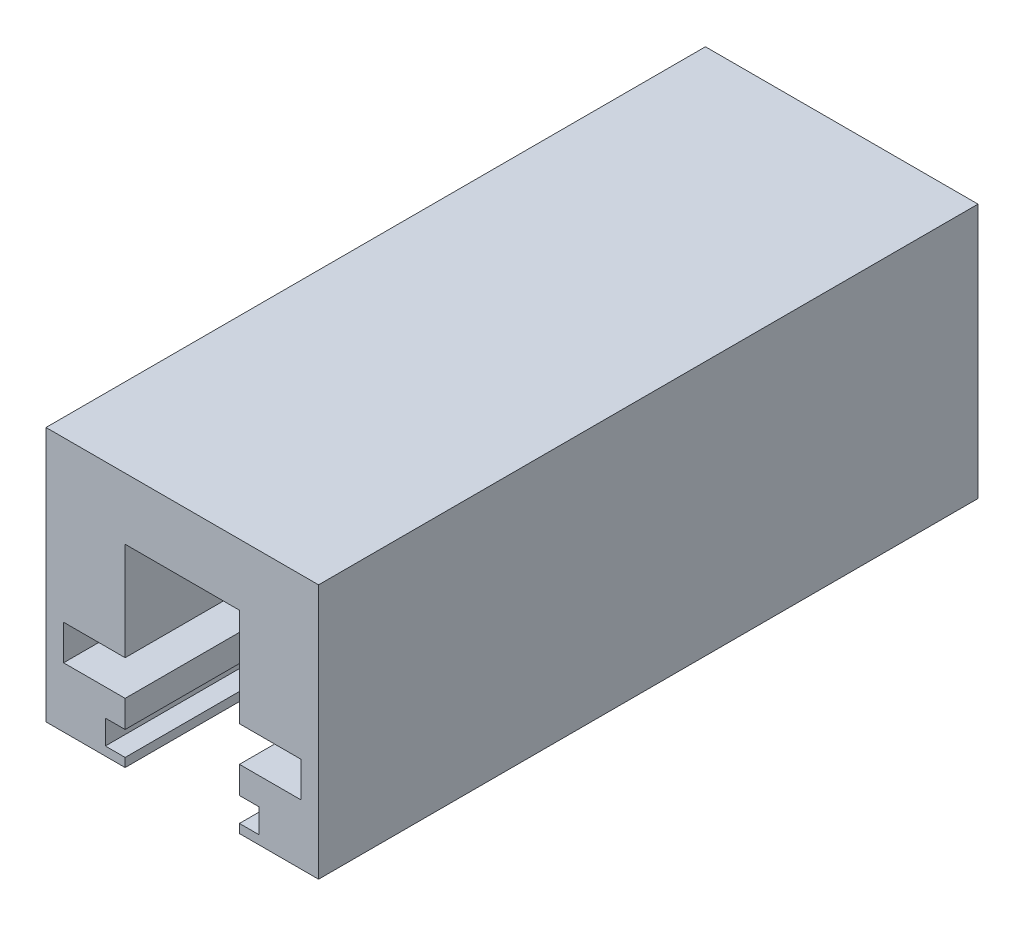
ISO-10303-21;
HEADER;
FILE_DESCRIPTION(('STEP AP214'),'2;1');
FILE_NAME('part.step','',(''),(''),'','','');
FILE_SCHEMA(('AUTOMOTIVE_DESIGN { 1 0 10303 214 1 1 1 1 }'));
ENDSEC;
DATA;
#1=APPLICATION_CONTEXT('core data for automotive mechanical design processes');
#2=APPLICATION_PROTOCOL_DEFINITION('international standard','automotive_design',2000,#1);
#3=PRODUCT_CONTEXT('',#1,'mechanical');
#4=PRODUCT('Part','Part','',(#3));
#5=PRODUCT_RELATED_PRODUCT_CATEGORY('part','',(#4));
#6=PRODUCT_DEFINITION_FORMATION('','',#4);
#7=PRODUCT_DEFINITION_CONTEXT('part definition',#1,'design');
#8=PRODUCT_DEFINITION('design','',#6,#7);
#9=PRODUCT_DEFINITION_SHAPE('','',#8);
#10=(LENGTH_UNIT() NAMED_UNIT(*) SI_UNIT(.MILLI.,.METRE.));
#11=(NAMED_UNIT(*) PLANE_ANGLE_UNIT() SI_UNIT($,.RADIAN.));
#12=(NAMED_UNIT(*) SI_UNIT($,.STERADIAN.) SOLID_ANGLE_UNIT());
#13=UNCERTAINTY_MEASURE_WITH_UNIT(LENGTH_MEASURE(1.E-05),#10,'distance_accuracy_value','');
#14=(GEOMETRIC_REPRESENTATION_CONTEXT(3) GLOBAL_UNCERTAINTY_ASSIGNED_CONTEXT((#13)) GLOBAL_UNIT_ASSIGNED_CONTEXT((#10,
#11,#12)) REPRESENTATION_CONTEXT('',''));
#15=CARTESIAN_POINT('',(0.,0.,0.));
#16=DIRECTION('',(0.,0.,1.));
#17=DIRECTION('',(1.,0.,0.));
#18=AXIS2_PLACEMENT_3D('',#15,#16,#17);
#19=CARTESIAN_POINT('',(0.,10.82,75.));
#20=DIRECTION('',(0.,-1.,0.));
#21=DIRECTION('',(1.,0.,0.));
#22=AXIS2_PLACEMENT_3D('',#19,#20,#21);
#23=PLANE('',#22);
#24=DIRECTION('',(-1.,0.,0.));
#25=VECTOR('',#24,1.);
#26=CARTESIAN_POINT('',(0.,10.82,0.));
#27=LINE('',#26,#25);
#28=CARTESIAN_POINT('',(-2.,10.82,0.));
#29=VERTEX_POINT('',#28);
#30=CARTESIAN_POINT('',(-9.,10.82,0.));
#31=VERTEX_POINT('',#30);
#32=EDGE_CURVE('E228',#29,#31,#27,.T.);
#33=ORIENTED_EDGE('',*,*,#32,.F.);
#34=DIRECTION('',(0.,0.,-1.));
#35=VECTOR('',#34,1.);
#36=CARTESIAN_POINT('',(-2.,10.82,75.));
#37=LINE('',#36,#35);
#38=CARTESIAN_POINT('',(-2.,10.82,75.));
#39=VERTEX_POINT('',#38);
#40=EDGE_CURVE('E11',#39,#29,#37,.T.);
#41=ORIENTED_EDGE('',*,*,#40,.F.);
#42=DIRECTION('',(-1.,0.,0.));
#43=VECTOR('',#42,1.);
#44=CARTESIAN_POINT('',(0.,10.82,75.));
#45=LINE('',#44,#43);
#46=CARTESIAN_POINT('',(-9.,10.82,75.));
#47=VERTEX_POINT('',#46);
#48=EDGE_CURVE('E351',#39,#47,#45,.T.);
#49=ORIENTED_EDGE('',*,*,#48,.T.);
#50=DIRECTION('',(0.,0.,-1.));
#51=VECTOR('',#50,1.);
#52=CARTESIAN_POINT('',(-9.,10.82,75.));
#53=LINE('',#52,#51);
#54=EDGE_CURVE('E51',#47,#31,#53,.T.);
#55=ORIENTED_EDGE('',*,*,#54,.T.);
#56=EDGE_LOOP('',(#33,#41,#49,#55));
#57=FACE_BOUND('',#56,.T.);
#58=ADVANCED_FACE('F35',(#57),#23,.T.);
#59=CARTESIAN_POINT('',(-2.,0.,75.));
#60=DIRECTION('',(-1.,0.,0.));
#61=DIRECTION('',(0.,0.,1.));
#62=AXIS2_PLACEMENT_3D('',#59,#60,#61);
#63=PLANE('',#62);
#64=DIRECTION('',(0.,1.,0.));
#65=VECTOR('',#64,1.);
#66=CARTESIAN_POINT('',(-2.,0.,0.));
#67=LINE('',#66,#65);
#68=CARTESIAN_POINT('',(-2.,6.81999999999999,0.));
#69=VERTEX_POINT('',#68);
#70=EDGE_CURVE('E230',#69,#29,#67,.T.);
#71=ORIENTED_EDGE('',*,*,#70,.F.);
#72=DIRECTION('',(0.,0.,-1.));
#73=VECTOR('',#72,1.);
#74=CARTESIAN_POINT('',(-2.,6.81999999999999,75.));
#75=LINE('',#74,#73);
#76=CARTESIAN_POINT('',(-2.,6.81999999999999,75.));
#77=VERTEX_POINT('',#76);
#78=EDGE_CURVE('E43',#77,#69,#75,.T.);
#79=ORIENTED_EDGE('',*,*,#78,.F.);
#80=DIRECTION('',(0.,1.,0.));
#81=VECTOR('',#80,1.);
#82=CARTESIAN_POINT('',(-2.,0.,75.));
#83=LINE('',#82,#81);
#84=EDGE_CURVE('E348',#77,#39,#83,.T.);
#85=ORIENTED_EDGE('',*,*,#84,.T.);
#86=ORIENTED_EDGE('',*,*,#40,.T.);
#87=EDGE_LOOP('',(#71,#79,#85,#86));
#88=FACE_BOUND('',#87,.T.);
#89=ADVANCED_FACE('F337',(#88),#63,.T.);
#90=CARTESIAN_POINT('',(0.,6.81999999999999,75.));
#91=DIRECTION('',(0.,1.,0.));
#92=DIRECTION('',(0.,0.,1.));
#93=AXIS2_PLACEMENT_3D('',#90,#91,#92);
#94=PLANE('',#93);
#95=DIRECTION('',(1.,0.,0.));
#96=VECTOR('',#95,1.);
#97=CARTESIAN_POINT('',(0.,6.81999999999999,0.));
#98=LINE('',#97,#96);
#99=CARTESIAN_POINT('',(-9.,6.81999999999999,0.));
#100=VERTEX_POINT('',#99);
#101=EDGE_CURVE('E233',#100,#69,#98,.T.);
#102=ORIENTED_EDGE('',*,*,#101,.F.);
#103=DIRECTION('',(0.,0.,-1.));
#104=VECTOR('',#103,1.);
#105=CARTESIAN_POINT('',(-9.,6.81999999999999,75.));
#106=LINE('',#105,#104);
#107=CARTESIAN_POINT('',(-9.,6.81999999999999,75.));
#108=VERTEX_POINT('',#107);
#109=EDGE_CURVE('E326',#108,#100,#106,.T.);
#110=ORIENTED_EDGE('',*,*,#109,.F.);
#111=DIRECTION('',(1.,0.,0.));
#112=VECTOR('',#111,1.);
#113=CARTESIAN_POINT('',(0.,6.81999999999999,75.));
#114=LINE('',#113,#112);
#115=EDGE_CURVE('E333',#108,#77,#114,.T.);
#116=ORIENTED_EDGE('',*,*,#115,.T.);
#117=ORIENTED_EDGE('',*,*,#78,.T.);
#118=EDGE_LOOP('',(#102,#110,#116,#117));
#119=FACE_BOUND('',#118,.T.);
#120=ADVANCED_FACE('F331',(#119),#94,.T.);
#121=CARTESIAN_POINT('',(-9.,0.,75.));
#122=DIRECTION('',(-1.,0.,0.));
#123=DIRECTION('',(0.,0.,1.));
#124=AXIS2_PLACEMENT_3D('',#121,#122,#123);
#125=PLANE('',#124);
#126=DIRECTION('',(0.,1.,0.));
#127=VECTOR('',#126,1.);
#128=CARTESIAN_POINT('',(-9.,0.,0.));
#129=LINE('',#128,#127);
#130=CARTESIAN_POINT('',(-9.,3.75,0.));
#131=VERTEX_POINT('',#130);
#132=EDGE_CURVE('E236',#131,#100,#129,.T.);
#133=ORIENTED_EDGE('',*,*,#132,.F.);
#134=DIRECTION('',(0.,0.,-1.));
#135=VECTOR('',#134,1.);
#136=CARTESIAN_POINT('',(-9.,3.75,75.));
#137=LINE('',#136,#135);
#138=CARTESIAN_POINT('',(-9.,3.75,75.));
#139=VERTEX_POINT('',#138);
#140=EDGE_CURVE('E324',#139,#131,#137,.T.);
#141=ORIENTED_EDGE('',*,*,#140,.F.);
#142=DIRECTION('',(0.,1.,0.));
#143=VECTOR('',#142,1.);
#144=CARTESIAN_POINT('',(-9.,0.,75.));
#145=LINE('',#144,#143);
#146=EDGE_CURVE('E224',#139,#108,#145,.T.);
#147=ORIENTED_EDGE('',*,*,#146,.T.);
#148=ORIENTED_EDGE('',*,*,#109,.T.);
#149=EDGE_LOOP('',(#133,#141,#147,#148));
#150=FACE_BOUND('',#149,.T.);
#151=ADVANCED_FACE('F343',(#150),#125,.T.);
#152=CARTESIAN_POINT('',(0.,3.75,75.));
#153=DIRECTION('',(0.,-1.,0.));
#154=DIRECTION('',(1.,0.,0.));
#155=AXIS2_PLACEMENT_3D('',#152,#153,#154);
#156=PLANE('',#155);
#157=DIRECTION('',(-1.,0.,0.));
#158=VECTOR('',#157,1.);
#159=CARTESIAN_POINT('',(0.,3.75,0.));
#160=LINE('',#159,#158);
#161=CARTESIAN_POINT('',(-6.75,3.75,0.));
#162=VERTEX_POINT('',#161);
#163=EDGE_CURVE('E239',#162,#131,#160,.T.);
#164=ORIENTED_EDGE('',*,*,#163,.F.);
#165=DIRECTION('',(0.,0.,-1.));
#166=VECTOR('',#165,1.);
#167=CARTESIAN_POINT('',(-6.75,3.75,75.));
#168=LINE('',#167,#166);
#169=CARTESIAN_POINT('',(-6.75,3.75,75.));
#170=VERTEX_POINT('',#169);
#171=EDGE_CURVE('E322',#170,#162,#168,.T.);
#172=ORIENTED_EDGE('',*,*,#171,.F.);
#173=DIRECTION('',(-1.,0.,0.));
#174=VECTOR('',#173,1.);
#175=CARTESIAN_POINT('',(0.,3.75,75.));
#176=LINE('',#175,#174);
#177=EDGE_CURVE('E350',#170,#139,#176,.T.);
#178=ORIENTED_EDGE('',*,*,#177,.T.);
#179=ORIENTED_EDGE('',*,*,#140,.T.);
#180=EDGE_LOOP('',(#164,#172,#178,#179));
#181=FACE_BOUND('',#180,.T.);
#182=ADVANCED_FACE('F460',(#181),#156,.T.);
#183=CARTESIAN_POINT('',(-6.75,0.,75.));
#184=DIRECTION('',(-1.,0.,0.));
#185=DIRECTION('',(0.,0.,1.));
#186=AXIS2_PLACEMENT_3D('',#183,#184,#185);
#187=PLANE('',#186);
#188=DIRECTION('',(0.,1.,0.));
#189=VECTOR('',#188,1.);
#190=CARTESIAN_POINT('',(-6.75,0.,0.));
#191=LINE('',#190,#189);
#192=CARTESIAN_POINT('',(-6.75,0.999999999999999,0.));
#193=VERTEX_POINT('',#192);
#194=EDGE_CURVE('E244',#193,#162,#191,.T.);
#195=ORIENTED_EDGE('',*,*,#194,.F.);
#196=DIRECTION('',(0.,0.,-1.));
#197=VECTOR('',#196,1.);
#198=CARTESIAN_POINT('',(-6.75,0.999999999999999,75.));
#199=LINE('',#198,#197);
#200=CARTESIAN_POINT('',(-6.75,0.999999999999999,75.));
#201=VERTEX_POINT('',#200);
#202=EDGE_CURVE('E320',#201,#193,#199,.T.);
#203=ORIENTED_EDGE('',*,*,#202,.F.);
#204=DIRECTION('',(0.,1.,0.));
#205=VECTOR('',#204,1.);
#206=CARTESIAN_POINT('',(-6.75,0.,75.));
#207=LINE('',#206,#205);
#208=EDGE_CURVE('E356',#201,#170,#207,.T.);
#209=ORIENTED_EDGE('',*,*,#208,.T.);
#210=ORIENTED_EDGE('',*,*,#171,.T.);
#211=EDGE_LOOP('',(#195,#203,#209,#210));
#212=FACE_BOUND('',#211,.T.);
#213=ADVANCED_FACE('F474',(#212),#187,.T.);
#214=CARTESIAN_POINT('',(0.,0.999999999999998,75.));
#215=DIRECTION('',(0.,1.,0.));
#216=DIRECTION('',(-1.,0.,0.));
#217=AXIS2_PLACEMENT_3D('',#214,#215,#216);
#218=PLANE('',#217);
#219=DIRECTION('',(1.,0.,0.));
#220=VECTOR('',#219,1.);
#221=CARTESIAN_POINT('',(0.,0.999999999999998,0.));
#222=LINE('',#221,#220);
#223=CARTESIAN_POINT('',(-9.,0.999999999999999,0.));
#224=VERTEX_POINT('',#223);
#225=EDGE_CURVE('E247',#224,#193,#222,.T.);
#226=ORIENTED_EDGE('',*,*,#225,.F.);
#227=DIRECTION('',(0.,0.,-1.));
#228=VECTOR('',#227,1.);
#229=CARTESIAN_POINT('',(-9.,0.999999999999999,75.));
#230=LINE('',#229,#228);
#231=CARTESIAN_POINT('',(-9.,0.999999999999999,75.));
#232=VERTEX_POINT('',#231);
#233=EDGE_CURVE('E318',#232,#224,#230,.T.);
#234=ORIENTED_EDGE('',*,*,#233,.F.);
#235=DIRECTION('',(1.,0.,0.));
#236=VECTOR('',#235,1.);
#237=CARTESIAN_POINT('',(0.,0.999999999999998,75.));
#238=LINE('',#237,#236);
#239=EDGE_CURVE('E359',#232,#201,#238,.T.);
#240=ORIENTED_EDGE('',*,*,#239,.T.);
#241=ORIENTED_EDGE('',*,*,#202,.T.);
#242=EDGE_LOOP('',(#226,#234,#240,#241));
#243=FACE_BOUND('',#242,.T.);
#244=ADVANCED_FACE('F462',(#243),#218,.T.);
#245=CARTESIAN_POINT('',(-9.,0.,0.));
#246=VERTEX_POINT('',#245);
#247=EDGE_CURVE('E241',#246,#224,#129,.T.);
#248=ORIENTED_EDGE('',*,*,#247,.F.);
#249=DIRECTION('',(0.,0.,-1.));
#250=VECTOR('',#249,1.);
#251=CARTESIAN_POINT('',(-9.,0.,75.));
#252=LINE('',#251,#250);
#253=CARTESIAN_POINT('',(-9.,0.,75.));
#254=VERTEX_POINT('',#253);
#255=EDGE_CURVE('E316',#254,#246,#252,.T.);
#256=ORIENTED_EDGE('',*,*,#255,.F.);
#257=EDGE_CURVE('E223',#254,#232,#145,.T.);
#258=ORIENTED_EDGE('',*,*,#257,.T.);
#259=ORIENTED_EDGE('',*,*,#233,.T.);
#260=EDGE_LOOP('',(#248,#256,#258,#259));
#261=FACE_BOUND('',#260,.T.);
#262=ADVANCED_FACE('F447',(#261),#125,.T.);
#263=CARTESIAN_POINT('',(0.,0.,75.));
#264=DIRECTION('',(0.,-1.,0.));
#265=DIRECTION('',(1.,0.,0.));
#266=AXIS2_PLACEMENT_3D('',#263,#264,#265);
#267=PLANE('',#266);
#268=DIRECTION('',(-1.,0.,0.));
#269=VECTOR('',#268,1.);
#270=CARTESIAN_POINT('',(0.,0.,0.));
#271=LINE('',#270,#269);
#272=CARTESIAN_POINT('',(0.,0.,0.));
#273=VERTEX_POINT('',#272);
#274=EDGE_CURVE('E250',#273,#246,#271,.T.);
#275=ORIENTED_EDGE('',*,*,#274,.F.);
#276=DIRECTION('',(0.,0.,-1.));
#277=VECTOR('',#276,1.);
#278=CARTESIAN_POINT('',(0.,0.,75.));
#279=LINE('',#278,#277);
#280=CARTESIAN_POINT('',(0.,0.,75.));
#281=VERTEX_POINT('',#280);
#282=EDGE_CURVE('E314',#281,#273,#279,.T.);
#283=ORIENTED_EDGE('',*,*,#282,.F.);
#284=DIRECTION('',(-1.,0.,0.));
#285=VECTOR('',#284,1.);
#286=CARTESIAN_POINT('',(0.,0.,75.));
#287=LINE('',#286,#285);
#288=EDGE_CURVE('E362',#281,#254,#287,.T.);
#289=ORIENTED_EDGE('',*,*,#288,.T.);
#290=ORIENTED_EDGE('',*,*,#255,.T.);
#291=EDGE_LOOP('',(#275,#283,#289,#290));
#292=FACE_BOUND('',#291,.T.);
#293=ADVANCED_FACE('F442',(#292),#267,.T.);
#294=CARTESIAN_POINT('',(0.,0.,75.));
#295=DIRECTION('',(1.,0.,0.));
#296=DIRECTION('',(0.,0.,-1.));
#297=AXIS2_PLACEMENT_3D('',#294,#295,#296);
#298=PLANE('',#297);
#299=DIRECTION('',(0.,-1.,0.));
#300=VECTOR('',#299,1.);
#301=CARTESIAN_POINT('',(0.,0.,0.));
#302=LINE('',#301,#300);
#303=CARTESIAN_POINT('',(0.,29.,0.));
#304=VERTEX_POINT('',#303);
#305=EDGE_CURVE('E253',#304,#273,#302,.T.);
#306=ORIENTED_EDGE('',*,*,#305,.F.);
#307=DIRECTION('',(0.,0.,-1.));
#308=VECTOR('',#307,1.);
#309=CARTESIAN_POINT('',(0.,29.,75.));
#310=LINE('',#309,#308);
#311=CARTESIAN_POINT('',(0.,29.,75.));
#312=VERTEX_POINT('',#311);
#313=EDGE_CURVE('E312',#312,#304,#310,.T.);
#314=ORIENTED_EDGE('',*,*,#313,.F.);
#315=DIRECTION('',(0.,-1.,0.));
#316=VECTOR('',#315,1.);
#317=CARTESIAN_POINT('',(0.,0.,75.));
#318=LINE('',#317,#316);
#319=EDGE_CURVE('E365',#312,#281,#318,.T.);
#320=ORIENTED_EDGE('',*,*,#319,.T.);
#321=ORIENTED_EDGE('',*,*,#282,.T.);
#322=EDGE_LOOP('',(#306,#314,#320,#321));
#323=FACE_BOUND('',#322,.T.);
#324=ADVANCED_FACE('F437',(#323),#298,.T.);
#325=CARTESIAN_POINT('',(0.,29.,75.));
#326=DIRECTION('',(0.,1.,0.));
#327=DIRECTION('',(-1.,0.,0.));
#328=AXIS2_PLACEMENT_3D('',#325,#326,#327);
#329=PLANE('',#328);
#330=DIRECTION('',(1.,0.,0.));
#331=VECTOR('',#330,1.);
#332=CARTESIAN_POINT('',(0.,29.,0.));
#333=LINE('',#332,#331);
#334=CARTESIAN_POINT('',(-31.,29.,0.));
#335=VERTEX_POINT('',#334);
#336=EDGE_CURVE('E256',#335,#304,#333,.T.);
#337=ORIENTED_EDGE('',*,*,#336,.F.);
#338=DIRECTION('',(0.,0.,-1.));
#339=VECTOR('',#338,1.);
#340=CARTESIAN_POINT('',(-31.,29.,75.));
#341=LINE('',#340,#339);
#342=CARTESIAN_POINT('',(-31.,29.,75.));
#343=VERTEX_POINT('',#342);
#344=EDGE_CURVE('E310',#343,#335,#341,.T.);
#345=ORIENTED_EDGE('',*,*,#344,.F.);
#346=DIRECTION('',(1.,0.,0.));
#347=VECTOR('',#346,1.);
#348=CARTESIAN_POINT('',(0.,29.,75.));
#349=LINE('',#348,#347);
#350=EDGE_CURVE('E368',#343,#312,#349,.T.);
#351=ORIENTED_EDGE('',*,*,#350,.T.);
#352=ORIENTED_EDGE('',*,*,#313,.T.);
#353=EDGE_LOOP('',(#337,#345,#351,#352));
#354=FACE_BOUND('',#353,.T.);
#355=ADVANCED_FACE('F433',(#354),#329,.T.);
#356=CARTESIAN_POINT('',(-31.,0.,75.));
#357=DIRECTION('',(-1.,0.,0.));
#358=DIRECTION('',(0.,0.,1.));
#359=AXIS2_PLACEMENT_3D('',#356,#357,#358);
#360=PLANE('',#359);
#361=DIRECTION('',(0.,1.,0.));
#362=VECTOR('',#361,1.);
#363=CARTESIAN_POINT('',(-31.,0.,0.));
#364=LINE('',#363,#362);
#365=CARTESIAN_POINT('',(-31.,0.,0.));
#366=VERTEX_POINT('',#365);
#367=EDGE_CURVE('E259',#366,#335,#364,.T.);
#368=ORIENTED_EDGE('',*,*,#367,.F.);
#369=DIRECTION('',(0.,0.,-1.));
#370=VECTOR('',#369,1.);
#371=CARTESIAN_POINT('',(-31.,0.,75.));
#372=LINE('',#371,#370);
#373=CARTESIAN_POINT('',(-31.,0.,75.));
#374=VERTEX_POINT('',#373);
#375=EDGE_CURVE('E308',#374,#366,#372,.T.);
#376=ORIENTED_EDGE('',*,*,#375,.F.);
#377=DIRECTION('',(0.,1.,0.));
#378=VECTOR('',#377,1.);
#379=CARTESIAN_POINT('',(-31.,0.,75.));
#380=LINE('',#379,#378);
#381=EDGE_CURVE('E371',#374,#343,#380,.T.);
#382=ORIENTED_EDGE('',*,*,#381,.T.);
#383=ORIENTED_EDGE('',*,*,#344,.T.);
#384=EDGE_LOOP('',(#368,#376,#382,#383));
#385=FACE_BOUND('',#384,.T.);
#386=ADVANCED_FACE('F429',(#385),#360,.T.);
#387=CARTESIAN_POINT('',(0.,0.,75.));
#388=DIRECTION('',(0.,-1.,0.));
#389=DIRECTION('',(1.,0.,0.));
#390=AXIS2_PLACEMENT_3D('',#387,#388,#389);
#391=PLANE('',#390);
#392=DIRECTION('',(-1.,0.,0.));
#393=VECTOR('',#392,1.);
#394=CARTESIAN_POINT('',(0.,0.,0.));
#395=LINE('',#394,#393);
#396=CARTESIAN_POINT('',(-22.,0.,0.));
#397=VERTEX_POINT('',#396);
#398=EDGE_CURVE('E262',#397,#366,#395,.T.);
#399=ORIENTED_EDGE('',*,*,#398,.F.);
#400=DIRECTION('',(0.,0.,-1.));
#401=VECTOR('',#400,1.);
#402=CARTESIAN_POINT('',(-22.,0.,75.));
#403=LINE('',#402,#401);
#404=CARTESIAN_POINT('',(-22.,0.,75.));
#405=VERTEX_POINT('',#404);
#406=EDGE_CURVE('E306',#405,#397,#403,.T.);
#407=ORIENTED_EDGE('',*,*,#406,.F.);
#408=DIRECTION('',(-1.,0.,0.));
#409=VECTOR('',#408,1.);
#410=CARTESIAN_POINT('',(0.,0.,75.));
#411=LINE('',#410,#409);
#412=EDGE_CURVE('E374',#405,#374,#411,.T.);
#413=ORIENTED_EDGE('',*,*,#412,.T.);
#414=ORIENTED_EDGE('',*,*,#375,.T.);
#415=EDGE_LOOP('',(#399,#407,#413,#414));
#416=FACE_BOUND('',#415,.T.);
#417=ADVANCED_FACE('F425',(#416),#391,.T.);
#418=CARTESIAN_POINT('',(-22.,0.,75.));
#419=DIRECTION('',(1.,0.,0.));
#420=DIRECTION('',(0.,1.,0.));
#421=AXIS2_PLACEMENT_3D('',#418,#419,#420);
#422=PLANE('',#421);
#423=DIRECTION('',(0.,-1.,0.));
#424=VECTOR('',#423,1.);
#425=CARTESIAN_POINT('',(-22.,0.,0.));
#426=LINE('',#425,#424);
#427=CARTESIAN_POINT('',(-22.,0.999999999999997,0.));
#428=VERTEX_POINT('',#427);
#429=EDGE_CURVE('E265',#428,#397,#426,.T.);
#430=ORIENTED_EDGE('',*,*,#429,.F.);
#431=DIRECTION('',(0.,0.,-1.));
#432=VECTOR('',#431,1.);
#433=CARTESIAN_POINT('',(-22.,0.999999999999997,75.));
#434=LINE('',#433,#432);
#435=CARTESIAN_POINT('',(-22.,0.999999999999997,75.));
#436=VERTEX_POINT('',#435);
#437=EDGE_CURVE('E304',#436,#428,#434,.T.);
#438=ORIENTED_EDGE('',*,*,#437,.F.);
#439=DIRECTION('',(0.,-1.,0.));
#440=VECTOR('',#439,1.);
#441=CARTESIAN_POINT('',(-22.,0.,75.));
#442=LINE('',#441,#440);
#443=EDGE_CURVE('E218',#436,#405,#442,.T.);
#444=ORIENTED_EDGE('',*,*,#443,.T.);
#445=ORIENTED_EDGE('',*,*,#406,.T.);
#446=EDGE_LOOP('',(#430,#438,#444,#445));
#447=FACE_BOUND('',#446,.T.);
#448=ADVANCED_FACE('F419',(#447),#422,.T.);
#449=CARTESIAN_POINT('',(0.,0.999999999999997,75.));
#450=DIRECTION('',(0.,-1.,0.));
#451=DIRECTION('',(0.,0.,-1.));
#452=AXIS2_PLACEMENT_3D('',#449,#450,#451);
#453=PLANE('',#452);
#454=DIRECTION('',(-1.,0.,0.));
#455=VECTOR('',#454,1.);
#456=CARTESIAN_POINT('',(0.,0.999999999999997,0.));
#457=LINE('',#456,#455);
#458=CARTESIAN_POINT('',(-24.25,0.999999999999997,0.));
#459=VERTEX_POINT('',#458);
#460=EDGE_CURVE('E268',#428,#459,#457,.T.);
#461=ORIENTED_EDGE('',*,*,#460,.T.);
#462=DIRECTION('',(0.,0.,-1.));
#463=VECTOR('',#462,1.);
#464=CARTESIAN_POINT('',(-24.25,0.999999999999997,75.));
#465=LINE('',#464,#463);
#466=CARTESIAN_POINT('',(-24.25,0.999999999999997,75.));
#467=VERTEX_POINT('',#466);
#468=EDGE_CURVE('E301',#467,#459,#465,.T.);
#469=ORIENTED_EDGE('',*,*,#468,.F.);
#470=DIRECTION('',(-1.,0.,0.));
#471=VECTOR('',#470,1.);
#472=CARTESIAN_POINT('',(0.,0.999999999999997,75.));
#473=LINE('',#472,#471);
#474=EDGE_CURVE('E378',#436,#467,#473,.T.);
#475=ORIENTED_EDGE('',*,*,#474,.F.);
#476=ORIENTED_EDGE('',*,*,#437,.T.);
#477=EDGE_LOOP('',(#461,#469,#475,#476));
#478=FACE_BOUND('',#477,.T.);
#479=ADVANCED_FACE('F492',(#478),#453,.F.);
#480=CARTESIAN_POINT('',(-24.25,0.,75.));
#481=DIRECTION('',(-1.,0.,0.));
#482=DIRECTION('',(0.,0.,1.));
#483=AXIS2_PLACEMENT_3D('',#480,#481,#482);
#484=PLANE('',#483);
#485=DIRECTION('',(0.,1.,0.));
#486=VECTOR('',#485,1.);
#487=CARTESIAN_POINT('',(-24.25,0.,0.));
#488=LINE('',#487,#486);
#489=CARTESIAN_POINT('',(-24.25,3.75,0.));
#490=VERTEX_POINT('',#489);
#491=EDGE_CURVE('E271',#459,#490,#488,.T.);
#492=ORIENTED_EDGE('',*,*,#491,.T.);
#493=DIRECTION('',(0.,0.,-1.));
#494=VECTOR('',#493,1.);
#495=CARTESIAN_POINT('',(-24.25,3.75,75.));
#496=LINE('',#495,#494);
#497=CARTESIAN_POINT('',(-24.25,3.75,75.));
#498=VERTEX_POINT('',#497);
#499=EDGE_CURVE('E298',#498,#490,#496,.T.);
#500=ORIENTED_EDGE('',*,*,#499,.F.);
#501=DIRECTION('',(0.,1.,0.));
#502=VECTOR('',#501,1.);
#503=CARTESIAN_POINT('',(-24.25,0.,75.));
#504=LINE('',#503,#502);
#505=EDGE_CURVE('E380',#467,#498,#504,.T.);
#506=ORIENTED_EDGE('',*,*,#505,.F.);
#507=ORIENTED_EDGE('',*,*,#468,.T.);
#508=EDGE_LOOP('',(#492,#500,#506,#507));
#509=FACE_BOUND('',#508,.T.);
#510=ADVANCED_FACE('F413',(#509),#484,.F.);
#511=CARTESIAN_POINT('',(0.,3.74999999999999,75.));
#512=DIRECTION('',(0.,1.,0.));
#513=DIRECTION('',(-1.,0.,0.));
#514=AXIS2_PLACEMENT_3D('',#511,#512,#513);
#515=PLANE('',#514);
#516=DIRECTION('',(1.,0.,0.));
#517=VECTOR('',#516,1.);
#518=CARTESIAN_POINT('',(0.,3.74999999999999,0.));
#519=LINE('',#518,#517);
#520=CARTESIAN_POINT('',(-22.,3.75,0.));
#521=VERTEX_POINT('',#520);
#522=EDGE_CURVE('E273',#490,#521,#519,.T.);
#523=ORIENTED_EDGE('',*,*,#522,.T.);
#524=DIRECTION('',(0.,0.,-1.));
#525=VECTOR('',#524,1.);
#526=CARTESIAN_POINT('',(-22.,3.75,75.));
#527=LINE('',#526,#525);
#528=CARTESIAN_POINT('',(-22.,3.75,75.));
#529=VERTEX_POINT('',#528);
#530=EDGE_CURVE('E296',#529,#521,#527,.T.);
#531=ORIENTED_EDGE('',*,*,#530,.F.);
#532=DIRECTION('',(1.,0.,0.));
#533=VECTOR('',#532,1.);
#534=CARTESIAN_POINT('',(0.,3.74999999999999,75.));
#535=LINE('',#534,#533);
#536=EDGE_CURVE('E382',#498,#529,#535,.T.);
#537=ORIENTED_EDGE('',*,*,#536,.F.);
#538=ORIENTED_EDGE('',*,*,#499,.T.);
#539=EDGE_LOOP('',(#523,#531,#537,#538));
#540=FACE_BOUND('',#539,.T.);
#541=ADVANCED_FACE('F409',(#540),#515,.F.);
#542=CARTESIAN_POINT('',(-22.,6.82,0.));
#543=VERTEX_POINT('',#542);
#544=EDGE_CURVE('E269',#543,#521,#426,.T.);
#545=ORIENTED_EDGE('',*,*,#544,.F.);
#546=DIRECTION('',(0.,0.,-1.));
#547=VECTOR('',#546,1.);
#548=CARTESIAN_POINT('',(-22.,6.82,75.));
#549=LINE('',#548,#547);
#550=CARTESIAN_POINT('',(-22.,6.82,75.));
#551=VERTEX_POINT('',#550);
#552=EDGE_CURVE('E294',#551,#543,#549,.T.);
#553=ORIENTED_EDGE('',*,*,#552,.F.);
#554=EDGE_CURVE('E217',#551,#529,#442,.T.);
#555=ORIENTED_EDGE('',*,*,#554,.T.);
#556=ORIENTED_EDGE('',*,*,#530,.T.);
#557=EDGE_LOOP('',(#545,#553,#555,#556));
#558=FACE_BOUND('',#557,.T.);
#559=ADVANCED_FACE('F404',(#558),#422,.T.);
#560=CARTESIAN_POINT('',(0.,6.82,75.));
#561=DIRECTION('',(0.,-1.,0.));
#562=DIRECTION('',(1.,0.,0.));
#563=AXIS2_PLACEMENT_3D('',#560,#561,#562);
#564=PLANE('',#563);
#565=DIRECTION('',(-1.,0.,0.));
#566=VECTOR('',#565,1.);
#567=CARTESIAN_POINT('',(0.,6.82,0.));
#568=LINE('',#567,#566);
#569=CARTESIAN_POINT('',(-29.,6.82,0.));
#570=VERTEX_POINT('',#569);
#571=EDGE_CURVE('E276',#543,#570,#568,.T.);
#572=ORIENTED_EDGE('',*,*,#571,.T.);
#573=DIRECTION('',(0.,0.,-1.));
#574=VECTOR('',#573,1.);
#575=CARTESIAN_POINT('',(-29.,6.82,75.));
#576=LINE('',#575,#574);
#577=CARTESIAN_POINT('',(-29.,6.82,75.));
#578=VERTEX_POINT('',#577);
#579=EDGE_CURVE('E291',#578,#570,#576,.T.);
#580=ORIENTED_EDGE('',*,*,#579,.F.);
#581=DIRECTION('',(-1.,0.,0.));
#582=VECTOR('',#581,1.);
#583=CARTESIAN_POINT('',(0.,6.82,75.));
#584=LINE('',#583,#582);
#585=EDGE_CURVE('E384',#551,#578,#584,.T.);
#586=ORIENTED_EDGE('',*,*,#585,.F.);
#587=ORIENTED_EDGE('',*,*,#552,.T.);
#588=EDGE_LOOP('',(#572,#580,#586,#587));
#589=FACE_BOUND('',#588,.T.);
#590=ADVANCED_FACE('F499',(#589),#564,.F.);
#591=CARTESIAN_POINT('',(-29.,0.,75.));
#592=DIRECTION('',(-1.,0.,0.));
#593=DIRECTION('',(0.,0.,1.));
#594=AXIS2_PLACEMENT_3D('',#591,#592,#593);
#595=PLANE('',#594);
#596=DIRECTION('',(0.,1.,0.));
#597=VECTOR('',#596,1.);
#598=CARTESIAN_POINT('',(-29.,0.,0.));
#599=LINE('',#598,#597);
#600=CARTESIAN_POINT('',(-29.,10.82,0.));
#601=VERTEX_POINT('',#600);
#602=EDGE_CURVE('E278',#570,#601,#599,.T.);
#603=ORIENTED_EDGE('',*,*,#602,.T.);
#604=DIRECTION('',(0.,0.,-1.));
#605=VECTOR('',#604,1.);
#606=CARTESIAN_POINT('',(-29.,10.82,75.));
#607=LINE('',#606,#605);
#608=CARTESIAN_POINT('',(-29.,10.82,75.));
#609=VERTEX_POINT('',#608);
#610=EDGE_CURVE('E288',#609,#601,#607,.T.);
#611=ORIENTED_EDGE('',*,*,#610,.F.);
#612=DIRECTION('',(0.,1.,0.));
#613=VECTOR('',#612,1.);
#614=CARTESIAN_POINT('',(-29.,0.,75.));
#615=LINE('',#614,#613);
#616=EDGE_CURVE('E385',#578,#609,#615,.T.);
#617=ORIENTED_EDGE('',*,*,#616,.F.);
#618=ORIENTED_EDGE('',*,*,#579,.T.);
#619=EDGE_LOOP('',(#603,#611,#617,#618));
#620=FACE_BOUND('',#619,.T.);
#621=ADVANCED_FACE('F392',(#620),#595,.F.);
#622=CARTESIAN_POINT('',(0.,10.82,75.));
#623=DIRECTION('',(0.,1.,0.));
#624=DIRECTION('',(0.,0.,1.));
#625=AXIS2_PLACEMENT_3D('',#622,#623,#624);
#626=PLANE('',#625);
#627=DIRECTION('',(1.,0.,0.));
#628=VECTOR('',#627,1.);
#629=CARTESIAN_POINT('',(0.,10.82,0.));
#630=LINE('',#629,#628);
#631=CARTESIAN_POINT('',(-22.,10.82,0.));
#632=VERTEX_POINT('',#631);
#633=EDGE_CURVE('E280',#601,#632,#630,.T.);
#634=ORIENTED_EDGE('',*,*,#633,.T.);
#635=DIRECTION('',(0.,0.,-1.));
#636=VECTOR('',#635,1.);
#637=CARTESIAN_POINT('',(-22.,10.82,75.));
#638=LINE('',#637,#636);
#639=CARTESIAN_POINT('',(-22.,10.82,75.));
#640=VERTEX_POINT('',#639);
#641=EDGE_CURVE('E206',#640,#632,#638,.T.);
#642=ORIENTED_EDGE('',*,*,#641,.F.);
#643=DIRECTION('',(1.,0.,0.));
#644=VECTOR('',#643,1.);
#645=CARTESIAN_POINT('',(0.,10.82,75.));
#646=LINE('',#645,#644);
#647=EDGE_CURVE('E214',#609,#640,#646,.T.);
#648=ORIENTED_EDGE('',*,*,#647,.F.);
#649=ORIENTED_EDGE('',*,*,#610,.T.);
#650=EDGE_LOOP('',(#634,#642,#648,#649));
#651=FACE_BOUND('',#650,.T.);
#652=ADVANCED_FACE('F396',(#651),#626,.F.);
#653=CARTESIAN_POINT('',(-22.,22.,0.));
#654=VERTEX_POINT('',#653);
#655=EDGE_CURVE('E202',#654,#632,#426,.T.);
#656=ORIENTED_EDGE('',*,*,#655,.F.);
#657=DIRECTION('',(0.,0.,-1.));
#658=VECTOR('',#657,1.);
#659=CARTESIAN_POINT('',(-22.,22.,75.));
#660=LINE('',#659,#658);
#661=CARTESIAN_POINT('',(-22.,22.,75.));
#662=VERTEX_POINT('',#661);
#663=EDGE_CURVE('E197',#662,#654,#660,.T.);
#664=ORIENTED_EDGE('',*,*,#663,.F.);
#665=EDGE_CURVE('E200',#662,#640,#442,.T.);
#666=ORIENTED_EDGE('',*,*,#665,.T.);
#667=ORIENTED_EDGE('',*,*,#641,.T.);
#668=EDGE_LOOP('',(#656,#664,#666,#667));
#669=FACE_BOUND('',#668,.T.);
#670=ADVANCED_FACE('F199',(#669),#422,.T.);
#671=CARTESIAN_POINT('',(0.,22.,75.));
#672=DIRECTION('',(0.,-1.,0.));
#673=DIRECTION('',(0.,0.,-1.));
#674=AXIS2_PLACEMENT_3D('',#671,#672,#673);
#675=PLANE('',#674);
#676=DIRECTION('',(-1.,0.,0.));
#677=VECTOR('',#676,1.);
#678=CARTESIAN_POINT('',(0.,22.,0.));
#679=LINE('',#678,#677);
#680=CARTESIAN_POINT('',(-9.,22.,0.));
#681=VERTEX_POINT('',#680);
#682=EDGE_CURVE('E283',#681,#654,#679,.T.);
#683=ORIENTED_EDGE('',*,*,#682,.F.);
#684=DIRECTION('',(0.,0.,-1.));
#685=VECTOR('',#684,1.);
#686=CARTESIAN_POINT('',(-9.,22.,75.));
#687=LINE('',#686,#685);
#688=CARTESIAN_POINT('',(-9.,22.,75.));
#689=VERTEX_POINT('',#688);
#690=EDGE_CURVE('E124',#689,#681,#687,.T.);
#691=ORIENTED_EDGE('',*,*,#690,.F.);
#692=DIRECTION('',(-1.,0.,0.));
#693=VECTOR('',#692,1.);
#694=CARTESIAN_POINT('',(0.,22.,75.));
#695=LINE('',#694,#693);
#696=EDGE_CURVE('E212',#689,#662,#695,.T.);
#697=ORIENTED_EDGE('',*,*,#696,.T.);
#698=ORIENTED_EDGE('',*,*,#663,.T.);
#699=EDGE_LOOP('',(#683,#691,#697,#698));
#700=FACE_BOUND('',#699,.T.);
#701=ADVANCED_FACE('F219',(#700),#675,.T.);
#702=EDGE_CURVE('E240',#31,#681,#129,.T.);
#703=ORIENTED_EDGE('',*,*,#702,.F.);
#704=ORIENTED_EDGE('',*,*,#54,.F.);
#705=EDGE_CURVE('E220',#47,#689,#145,.T.);
#706=ORIENTED_EDGE('',*,*,#705,.T.);
#707=ORIENTED_EDGE('',*,*,#690,.T.);
#708=EDGE_LOOP('',(#703,#704,#706,#707));
#709=FACE_BOUND('',#708,.T.);
#710=ADVANCED_FACE('F449',(#709),#125,.T.);
#711=CARTESIAN_POINT('',(0.,0.,75.));
#712=DIRECTION('',(0.,0.,1.));
#713=DIRECTION('',(1.,0.,0.));
#714=AXIS2_PLACEMENT_3D('',#711,#712,#713);
#715=PLANE('',#714);
#716=ORIENTED_EDGE('',*,*,#48,.F.);
#717=ORIENTED_EDGE('',*,*,#84,.F.);
#718=ORIENTED_EDGE('',*,*,#115,.F.);
#719=ORIENTED_EDGE('',*,*,#146,.F.);
#720=ORIENTED_EDGE('',*,*,#177,.F.);
#721=ORIENTED_EDGE('',*,*,#208,.F.);
#722=ORIENTED_EDGE('',*,*,#239,.F.);
#723=ORIENTED_EDGE('',*,*,#257,.F.);
#724=ORIENTED_EDGE('',*,*,#288,.F.);
#725=ORIENTED_EDGE('',*,*,#319,.F.);
#726=ORIENTED_EDGE('',*,*,#350,.F.);
#727=ORIENTED_EDGE('',*,*,#381,.F.);
#728=ORIENTED_EDGE('',*,*,#412,.F.);
#729=ORIENTED_EDGE('',*,*,#443,.F.);
#730=ORIENTED_EDGE('',*,*,#474,.T.);
#731=ORIENTED_EDGE('',*,*,#505,.T.);
#732=ORIENTED_EDGE('',*,*,#536,.T.);
#733=ORIENTED_EDGE('',*,*,#554,.F.);
#734=ORIENTED_EDGE('',*,*,#585,.T.);
#735=ORIENTED_EDGE('',*,*,#616,.T.);
#736=ORIENTED_EDGE('',*,*,#647,.T.);
#737=ORIENTED_EDGE('',*,*,#665,.F.);
#738=ORIENTED_EDGE('',*,*,#696,.F.);
#739=ORIENTED_EDGE('',*,*,#705,.F.);
#740=EDGE_LOOP('',(#716,#717,#718,#719,#720,#721,#722,#723,#724,#725,#726,#727,#728,#729,#730,
#731,#732,#733,#734,#735,#736,#737,#738,#739));
#741=FACE_BOUND('',#740,.T.);
#742=ADVANCED_FACE('F210',(#741),#715,.T.);
#743=CARTESIAN_POINT('',(0.,0.,0.));
#744=DIRECTION('',(0.,0.,1.));
#745=DIRECTION('',(1.,0.,0.));
#746=AXIS2_PLACEMENT_3D('',#743,#744,#745);
#747=PLANE('',#746);
#748=ORIENTED_EDGE('',*,*,#32,.T.);
#749=ORIENTED_EDGE('',*,*,#702,.T.);
#750=ORIENTED_EDGE('',*,*,#682,.T.);
#751=ORIENTED_EDGE('',*,*,#655,.T.);
#752=ORIENTED_EDGE('',*,*,#633,.F.);
#753=ORIENTED_EDGE('',*,*,#602,.F.);
#754=ORIENTED_EDGE('',*,*,#571,.F.);
#755=ORIENTED_EDGE('',*,*,#544,.T.);
#756=ORIENTED_EDGE('',*,*,#522,.F.);
#757=ORIENTED_EDGE('',*,*,#491,.F.);
#758=ORIENTED_EDGE('',*,*,#460,.F.);
#759=ORIENTED_EDGE('',*,*,#429,.T.);
#760=ORIENTED_EDGE('',*,*,#398,.T.);
#761=ORIENTED_EDGE('',*,*,#367,.T.);
#762=ORIENTED_EDGE('',*,*,#336,.T.);
#763=ORIENTED_EDGE('',*,*,#305,.T.);
#764=ORIENTED_EDGE('',*,*,#274,.T.);
#765=ORIENTED_EDGE('',*,*,#247,.T.);
#766=ORIENTED_EDGE('',*,*,#225,.T.);
#767=ORIENTED_EDGE('',*,*,#194,.T.);
#768=ORIENTED_EDGE('',*,*,#163,.T.);
#769=ORIENTED_EDGE('',*,*,#132,.T.);
#770=ORIENTED_EDGE('',*,*,#101,.T.);
#771=ORIENTED_EDGE('',*,*,#70,.T.);
#772=EDGE_LOOP('',(#748,#749,#750,#751,#752,#753,#754,#755,#756,#757,#758,#759,#760,#761,#762,
#763,#764,#765,#766,#767,#768,#769,#770,#771));
#773=FACE_BOUND('',#772,.T.);
#774=ADVANCED_FACE('F339',(#773),#747,.F.);
#775=CLOSED_SHELL('',(#58,#89,#120,#151,#182,#213,#244,#262,#293,#324,#355,#386,#417,#448,#479,
#510,#541,#559,#590,#621,#652,#670,#701,#710,#742,#774));
#776=MANIFOLD_SOLID_BREP('B2',#775);
#777=ADVANCED_BREP_SHAPE_REPRESENTATION('',(#18,#776),#14);
#778=SHAPE_DEFINITION_REPRESENTATION(#9,#777);
ENDSEC;
END-ISO-10303-21;
